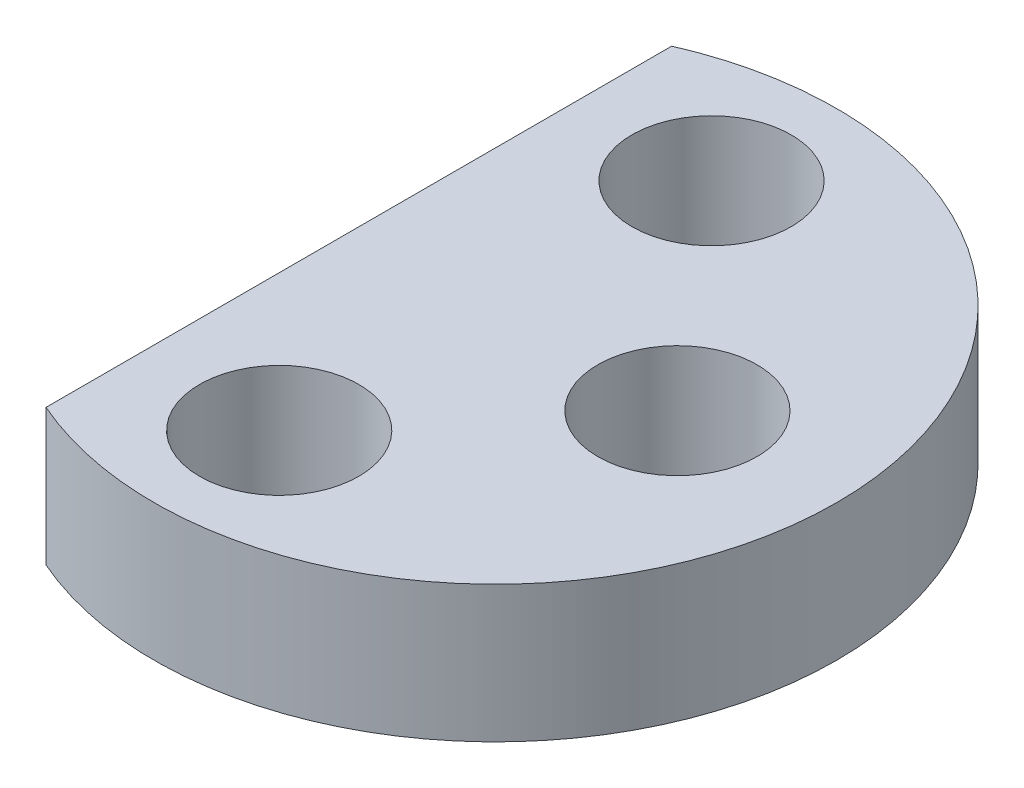
ISO-10303-21;
HEADER;
FILE_DESCRIPTION(('STEP AP214'),'2;1');
FILE_NAME('part.step','',(''),(''),'','','');
FILE_SCHEMA(('AUTOMOTIVE_DESIGN { 1 0 10303 214 1 1 1 1 }'));
ENDSEC;
DATA;
#1=APPLICATION_CONTEXT('core data for automotive mechanical design processes');
#2=APPLICATION_PROTOCOL_DEFINITION('international standard','automotive_design',2000,#1);
#3=PRODUCT_CONTEXT('',#1,'mechanical');
#4=PRODUCT('Part','Part','',(#3));
#5=PRODUCT_RELATED_PRODUCT_CATEGORY('part','',(#4));
#6=PRODUCT_DEFINITION_FORMATION('','',#4);
#7=PRODUCT_DEFINITION_CONTEXT('part definition',#1,'design');
#8=PRODUCT_DEFINITION('design','',#6,#7);
#9=PRODUCT_DEFINITION_SHAPE('','',#8);
#10=(LENGTH_UNIT() NAMED_UNIT(*) SI_UNIT(.MILLI.,.METRE.));
#11=(NAMED_UNIT(*) PLANE_ANGLE_UNIT() SI_UNIT($,.RADIAN.));
#12=(NAMED_UNIT(*) SI_UNIT($,.STERADIAN.) SOLID_ANGLE_UNIT());
#13=UNCERTAINTY_MEASURE_WITH_UNIT(LENGTH_MEASURE(1.E-05),#10,'distance_accuracy_value','');
#14=(GEOMETRIC_REPRESENTATION_CONTEXT(3) GLOBAL_UNCERTAINTY_ASSIGNED_CONTEXT((#13)) GLOBAL_UNIT_ASSIGNED_CONTEXT((#10,
#11,#12)) REPRESENTATION_CONTEXT('',''));
#15=CARTESIAN_POINT('',(0.,0.,0.));
#16=DIRECTION('',(0.,0.,1.));
#17=DIRECTION('',(1.,0.,0.));
#18=AXIS2_PLACEMENT_3D('',#15,#16,#17);
#19=CARTESIAN_POINT('',(0.,3.,0.));
#20=DIRECTION('',(0.,1.,0.));
#21=DIRECTION('',(0.,0.,1.));
#22=AXIS2_PLACEMENT_3D('',#19,#20,#21);
#23=PLANE('',#22);
#24=CARTESIAN_POINT('',(0.,3.,4.75));
#25=DIRECTION('',(0.,1.,0.));
#26=DIRECTION('',(0.,0.,1.));
#27=AXIS2_PLACEMENT_3D('',#24,#25,#26);
#28=CIRCLE('',#27,1.75);
#29=CARTESIAN_POINT('',(0.,3.,6.5));
#30=VERTEX_POINT('',#29);
#31=EDGE_CURVE('E79',#30,#30,#28,.T.);
#32=ORIENTED_EDGE('',*,*,#31,.F.);
#33=EDGE_LOOP('',(#32));
#34=FACE_BOUND('',#33,.T.);
#35=CARTESIAN_POINT('',(0.,3.,0.));
#36=DIRECTION('',(0.,1.,0.));
#37=DIRECTION('',(0.,0.,1.));
#38=AXIS2_PLACEMENT_3D('',#35,#36,#37);
#39=CIRCLE('',#38,7.5);
#40=CARTESIAN_POINT('',(-3.,3.,6.87386354243376));
#41=VERTEX_POINT('',#40);
#42=CARTESIAN_POINT('',(-3.,3.,-6.87386354243376));
#43=VERTEX_POINT('',#42);
#44=EDGE_CURVE('E64',#41,#43,#39,.T.);
#45=ORIENTED_EDGE('',*,*,#44,.T.);
#46=DIRECTION('',(0.,0.,1.));
#47=VECTOR('',#46,1.);
#48=CARTESIAN_POINT('',(-3.,3.,-6.87386354243376));
#49=LINE('',#48,#47);
#50=EDGE_CURVE('E49',#43,#41,#49,.T.);
#51=ORIENTED_EDGE('',*,*,#50,.T.);
#52=EDGE_LOOP('',(#45,#51));
#53=FACE_BOUND('',#52,.T.);
#54=CARTESIAN_POINT('',(0.,3.,-4.75));
#55=DIRECTION('',(0.,1.,0.));
#56=DIRECTION('',(0.,0.,1.));
#57=AXIS2_PLACEMENT_3D('',#54,#55,#56);
#58=CIRCLE('',#57,1.75);
#59=CARTESIAN_POINT('',(0.,3.,-3.));
#60=VERTEX_POINT('',#59);
#61=EDGE_CURVE('E70',#60,#60,#58,.T.);
#62=ORIENTED_EDGE('',*,*,#61,.F.);
#63=EDGE_LOOP('',(#62));
#64=FACE_BOUND('',#63,.T.);
#65=CARTESIAN_POINT('',(4.,3.,0.));
#66=DIRECTION('',(0.,1.,0.));
#67=DIRECTION('',(0.,0.,1.));
#68=AXIS2_PLACEMENT_3D('',#65,#66,#67);
#69=CIRCLE('',#68,1.75);
#70=CARTESIAN_POINT('',(4.,3.,1.75));
#71=VERTEX_POINT('',#70);
#72=EDGE_CURVE('E84',#71,#71,#69,.T.);
#73=ORIENTED_EDGE('',*,*,#72,.F.);
#74=EDGE_LOOP('',(#73));
#75=FACE_BOUND('',#74,.T.);
#76=ADVANCED_FACE('F33',(#34,#53,#64,#75),#23,.T.);
#77=CARTESIAN_POINT('',(0.,0.,0.));
#78=DIRECTION('',(0.,1.,0.));
#79=DIRECTION('',(0.,0.,1.));
#80=AXIS2_PLACEMENT_3D('',#77,#78,#79);
#81=PLANE('',#80);
#82=CARTESIAN_POINT('',(0.,0.,0.));
#83=DIRECTION('',(0.,1.,0.));
#84=DIRECTION('',(0.,0.,1.));
#85=AXIS2_PLACEMENT_3D('',#82,#83,#84);
#86=CIRCLE('',#85,7.5);
#87=CARTESIAN_POINT('',(-3.,0.,6.87386354243376));
#88=VERTEX_POINT('',#87);
#89=CARTESIAN_POINT('',(-3.,0.,-6.87386354243376));
#90=VERTEX_POINT('',#89);
#91=EDGE_CURVE('E65',#88,#90,#86,.T.);
#92=ORIENTED_EDGE('',*,*,#91,.F.);
#93=DIRECTION('',(0.,0.,1.));
#94=VECTOR('',#93,1.);
#95=CARTESIAN_POINT('',(-3.,0.,-6.87386354243376));
#96=LINE('',#95,#94);
#97=EDGE_CURVE('E57',#90,#88,#96,.T.);
#98=ORIENTED_EDGE('',*,*,#97,.F.);
#99=EDGE_LOOP('',(#92,#98));
#100=FACE_BOUND('',#99,.T.);
#101=CARTESIAN_POINT('',(0.,0.,-4.75));
#102=DIRECTION('',(0.,1.,0.));
#103=DIRECTION('',(0.,0.,1.));
#104=AXIS2_PLACEMENT_3D('',#101,#102,#103);
#105=CIRCLE('',#104,1.75);
#106=CARTESIAN_POINT('',(0.,0.,-3.));
#107=VERTEX_POINT('',#106);
#108=EDGE_CURVE('E73',#107,#107,#105,.T.);
#109=ORIENTED_EDGE('',*,*,#108,.T.);
#110=EDGE_LOOP('',(#109));
#111=FACE_BOUND('',#110,.T.);
#112=CARTESIAN_POINT('',(0.,0.,4.75));
#113=DIRECTION('',(0.,1.,0.));
#114=DIRECTION('',(0.,0.,1.));
#115=AXIS2_PLACEMENT_3D('',#112,#113,#114);
#116=CIRCLE('',#115,1.75);
#117=CARTESIAN_POINT('',(0.,0.,6.5));
#118=VERTEX_POINT('',#117);
#119=EDGE_CURVE('E81',#118,#118,#116,.T.);
#120=ORIENTED_EDGE('',*,*,#119,.T.);
#121=EDGE_LOOP('',(#120));
#122=FACE_BOUND('',#121,.T.);
#123=CARTESIAN_POINT('',(4.,0.,0.));
#124=DIRECTION('',(0.,1.,0.));
#125=DIRECTION('',(0.,0.,1.));
#126=AXIS2_PLACEMENT_3D('',#123,#124,#125);
#127=CIRCLE('',#126,1.75);
#128=CARTESIAN_POINT('',(4.,0.,1.75));
#129=VERTEX_POINT('',#128);
#130=EDGE_CURVE('E87',#129,#129,#127,.T.);
#131=ORIENTED_EDGE('',*,*,#130,.T.);
#132=EDGE_LOOP('',(#131));
#133=FACE_BOUND('',#132,.T.);
#134=ADVANCED_FACE('F68',(#100,#111,#122,#133),#81,.F.);
#135=CARTESIAN_POINT('',(0.,3.,0.));
#136=DIRECTION('',(0.,-1.,0.));
#137=DIRECTION('',(0.,0.,-1.));
#138=AXIS2_PLACEMENT_3D('',#135,#136,#137);
#139=CYLINDRICAL_SURFACE('',#138,7.5);
#140=ORIENTED_EDGE('',*,*,#91,.T.);
#141=DIRECTION('',(0.,-1.,0.));
#142=VECTOR('',#141,1.);
#143=CARTESIAN_POINT('',(-3.,3.,-6.87386354243376));
#144=LINE('',#143,#142);
#145=EDGE_CURVE('E11',#43,#90,#144,.T.);
#146=ORIENTED_EDGE('',*,*,#145,.F.);
#147=ORIENTED_EDGE('',*,*,#44,.F.);
#148=DIRECTION('',(0.,-1.,0.));
#149=VECTOR('',#148,1.);
#150=CARTESIAN_POINT('',(-3.,3.,6.87386354243376));
#151=LINE('',#150,#149);
#152=EDGE_CURVE('E42',#41,#88,#151,.T.);
#153=ORIENTED_EDGE('',*,*,#152,.T.);
#154=EDGE_LOOP('',(#140,#146,#147,#153));
#155=FACE_BOUND('',#154,.T.);
#156=ADVANCED_FACE('F35',(#155),#139,.T.);
#157=CARTESIAN_POINT('',(-3.,3.,-6.87386354243376));
#158=DIRECTION('',(1.,0.,0.));
#159=DIRECTION('',(0.,0.,-1.));
#160=AXIS2_PLACEMENT_3D('',#157,#158,#159);
#161=PLANE('',#160);
#162=ORIENTED_EDGE('',*,*,#97,.T.);
#163=ORIENTED_EDGE('',*,*,#152,.F.);
#164=ORIENTED_EDGE('',*,*,#50,.F.);
#165=ORIENTED_EDGE('',*,*,#145,.T.);
#166=EDGE_LOOP('',(#162,#163,#164,#165));
#167=FACE_BOUND('',#166,.T.);
#168=ADVANCED_FACE('F60',(#167),#161,.F.);
#169=CARTESIAN_POINT('',(0.,3.,-4.75));
#170=DIRECTION('',(0.,-1.,0.));
#171=DIRECTION('',(0.,0.,-1.));
#172=AXIS2_PLACEMENT_3D('',#169,#170,#171);
#173=CYLINDRICAL_SURFACE('',#172,1.75);
#174=ORIENTED_EDGE('',*,*,#61,.T.);
#175=EDGE_LOOP('',(#174));
#176=FACE_BOUND('',#175,.T.);
#177=ORIENTED_EDGE('',*,*,#108,.F.);
#178=EDGE_LOOP('',(#177));
#179=FACE_BOUND('',#178,.T.);
#180=ADVANCED_FACE('F105',(#176,#179),#173,.F.);
#181=CARTESIAN_POINT('',(0.,3.,4.75));
#182=DIRECTION('',(0.,-1.,0.));
#183=DIRECTION('',(0.,0.,-1.));
#184=AXIS2_PLACEMENT_3D('',#181,#182,#183);
#185=CYLINDRICAL_SURFACE('',#184,1.75);
#186=ORIENTED_EDGE('',*,*,#31,.T.);
#187=EDGE_LOOP('',(#186));
#188=FACE_BOUND('',#187,.T.);
#189=ORIENTED_EDGE('',*,*,#119,.F.);
#190=EDGE_LOOP('',(#189));
#191=FACE_BOUND('',#190,.T.);
#192=ADVANCED_FACE('F112',(#188,#191),#185,.F.);
#193=CARTESIAN_POINT('',(4.,3.,0.));
#194=DIRECTION('',(0.,-1.,0.));
#195=DIRECTION('',(0.,0.,-1.));
#196=AXIS2_PLACEMENT_3D('',#193,#194,#195);
#197=CYLINDRICAL_SURFACE('',#196,1.75);
#198=ORIENTED_EDGE('',*,*,#72,.T.);
#199=EDGE_LOOP('',(#198));
#200=FACE_BOUND('',#199,.T.);
#201=ORIENTED_EDGE('',*,*,#130,.F.);
#202=EDGE_LOOP('',(#201));
#203=FACE_BOUND('',#202,.T.);
#204=ADVANCED_FACE('F93',(#200,#203),#197,.F.);
#205=CLOSED_SHELL('',(#76,#134,#156,#168,#180,#192,#204));
#206=MANIFOLD_SOLID_BREP('B2',#205);
#207=ADVANCED_BREP_SHAPE_REPRESENTATION('',(#18,#206),#14);
#208=SHAPE_DEFINITION_REPRESENTATION(#9,#207);
ENDSEC;
END-ISO-10303-21;
